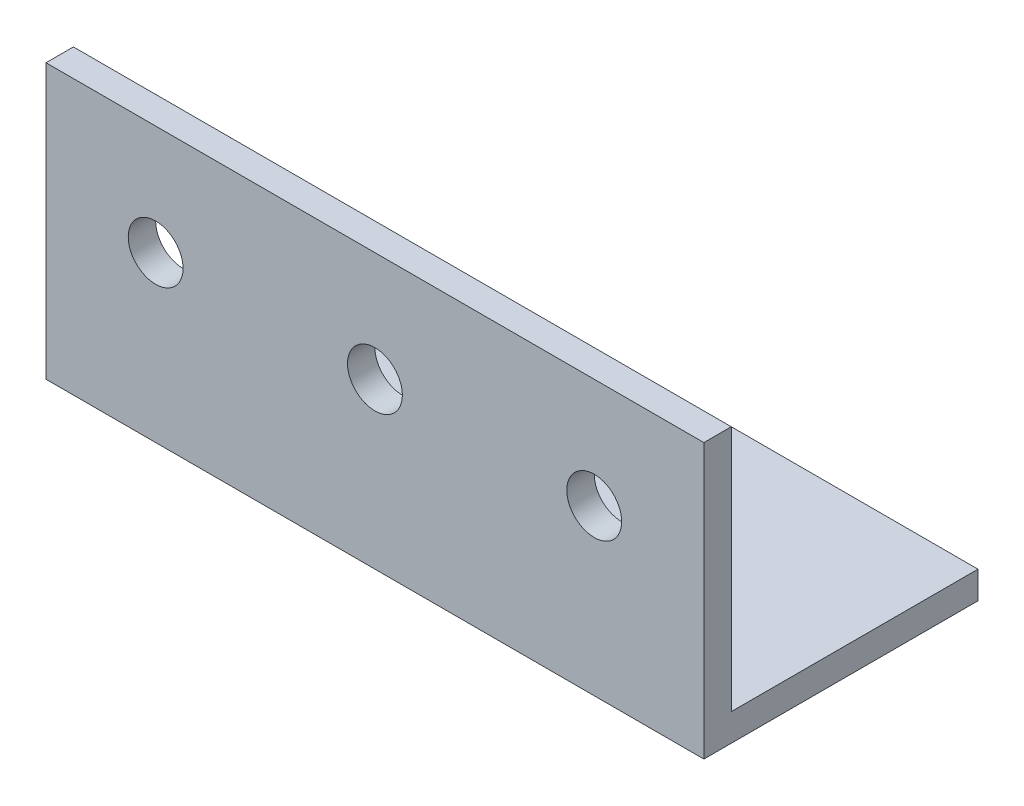
ISO-10303-21;
HEADER;
FILE_DESCRIPTION(('STEP AP214'),'2;1');
FILE_NAME('part.step','',(''),(''),'','','');
FILE_SCHEMA(('AUTOMOTIVE_DESIGN { 1 0 10303 214 1 1 1 1 }'));
ENDSEC;
DATA;
#1=APPLICATION_CONTEXT('core data for automotive mechanical design processes');
#2=APPLICATION_PROTOCOL_DEFINITION('international standard','automotive_design',2000,#1);
#3=PRODUCT_CONTEXT('',#1,'mechanical');
#4=PRODUCT('Part','Part','',(#3));
#5=PRODUCT_RELATED_PRODUCT_CATEGORY('part','',(#4));
#6=PRODUCT_DEFINITION_FORMATION('','',#4);
#7=PRODUCT_DEFINITION_CONTEXT('part definition',#1,'design');
#8=PRODUCT_DEFINITION('design','',#6,#7);
#9=PRODUCT_DEFINITION_SHAPE('','',#8);
#10=(LENGTH_UNIT() NAMED_UNIT(*) SI_UNIT(.MILLI.,.METRE.));
#11=(NAMED_UNIT(*) PLANE_ANGLE_UNIT() SI_UNIT($,.RADIAN.));
#12=(NAMED_UNIT(*) SI_UNIT($,.STERADIAN.) SOLID_ANGLE_UNIT());
#13=UNCERTAINTY_MEASURE_WITH_UNIT(LENGTH_MEASURE(1.E-05),#10,'distance_accuracy_value','');
#14=(GEOMETRIC_REPRESENTATION_CONTEXT(3) GLOBAL_UNCERTAINTY_ASSIGNED_CONTEXT((#13)) GLOBAL_UNIT_ASSIGNED_CONTEXT((#10,
#11,#12)) REPRESENTATION_CONTEXT('',''));
#15=CARTESIAN_POINT('',(0.,0.,0.));
#16=DIRECTION('',(0.,0.,1.));
#17=DIRECTION('',(1.,0.,0.));
#18=AXIS2_PLACEMENT_3D('',#15,#16,#17);
#19=CARTESIAN_POINT('',(76.2,0.,3.175));
#20=DIRECTION('',(0.,0.,1.));
#21=DIRECTION('',(1.,0.,0.));
#22=AXIS2_PLACEMENT_3D('',#19,#20,#21);
#23=PLANE('',#22);
#24=CARTESIAN_POINT('',(12.7,15.875,3.17500000000001));
#25=DIRECTION('',(0.,0.,1.));
#26=DIRECTION('',(1.,0.,0.));
#27=AXIS2_PLACEMENT_3D('',#24,#25,#26);
#28=CIRCLE('',#27,3.175);
#29=CARTESIAN_POINT('',(15.875,15.875,3.17500000000001));
#30=VERTEX_POINT('',#29);
#31=EDGE_CURVE('E134',#30,#30,#28,.T.);
#32=ORIENTED_EDGE('',*,*,#31,.F.);
#33=EDGE_LOOP('',(#32));
#34=FACE_BOUND('',#33,.T.);
#35=CARTESIAN_POINT('',(63.5,15.875,3.17500000000001));
#36=DIRECTION('',(0.,0.,1.));
#37=DIRECTION('',(1.,0.,0.));
#38=AXIS2_PLACEMENT_3D('',#35,#36,#37);
#39=CIRCLE('',#38,3.175);
#40=CARTESIAN_POINT('',(66.675,15.875,3.17500000000001));
#41=VERTEX_POINT('',#40);
#42=EDGE_CURVE('E175',#41,#41,#39,.T.);
#43=ORIENTED_EDGE('',*,*,#42,.F.);
#44=EDGE_LOOP('',(#43));
#45=FACE_BOUND('',#44,.T.);
#46=CARTESIAN_POINT('',(38.1,15.875,3.17500000000001));
#47=DIRECTION('',(0.,0.,1.));
#48=DIRECTION('',(1.,0.,0.));
#49=AXIS2_PLACEMENT_3D('',#46,#47,#48);
#50=CIRCLE('',#49,3.175);
#51=CARTESIAN_POINT('',(41.275,15.875,3.17500000000001));
#52=VERTEX_POINT('',#51);
#53=EDGE_CURVE('E179',#52,#52,#50,.T.);
#54=ORIENTED_EDGE('',*,*,#53,.F.);
#55=EDGE_LOOP('',(#54));
#56=FACE_BOUND('',#55,.T.);
#57=DIRECTION('',(0.,1.,0.));
#58=VECTOR('',#57,1.);
#59=CARTESIAN_POINT('',(0.,0.,3.175));
#60=LINE('',#59,#58);
#61=CARTESIAN_POINT('',(0.,-3.17499999999998,3.175));
#62=VERTEX_POINT('',#61);
#63=CARTESIAN_POINT('',(0.,28.575,3.175));
#64=VERTEX_POINT('',#63);
#65=EDGE_CURVE('E129',#62,#64,#60,.T.);
#66=ORIENTED_EDGE('',*,*,#65,.F.);
#67=DIRECTION('',(-1.,0.,0.));
#68=VECTOR('',#67,1.);
#69=CARTESIAN_POINT('',(76.2,-3.17499999999998,3.175));
#70=LINE('',#69,#68);
#71=CARTESIAN_POINT('',(76.2,-3.17499999999998,3.175));
#72=VERTEX_POINT('',#71);
#73=EDGE_CURVE('E11',#72,#62,#70,.T.);
#74=ORIENTED_EDGE('',*,*,#73,.F.);
#75=DIRECTION('',(0.,1.,0.));
#76=VECTOR('',#75,1.);
#77=CARTESIAN_POINT('',(76.2,0.,3.175));
#78=LINE('',#77,#76);
#79=CARTESIAN_POINT('',(76.2,28.575,3.175));
#80=VERTEX_POINT('',#79);
#81=EDGE_CURVE('E149',#72,#80,#78,.T.);
#82=ORIENTED_EDGE('',*,*,#81,.T.);
#83=DIRECTION('',(-1.,0.,0.));
#84=VECTOR('',#83,1.);
#85=CARTESIAN_POINT('',(76.2,28.575,3.175));
#86=LINE('',#85,#84);
#87=EDGE_CURVE('E86',#80,#64,#86,.T.);
#88=ORIENTED_EDGE('',*,*,#87,.T.);
#89=EDGE_LOOP('',(#66,#74,#82,#88));
#90=FACE_BOUND('',#89,.T.);
#91=ADVANCED_FACE('F41',(#34,#45,#56,#90),#23,.T.);
#92=CARTESIAN_POINT('',(76.2,-3.17499999999998,0.));
#93=DIRECTION('',(0.,1.,0.));
#94=DIRECTION('',(0.,0.,1.));
#95=AXIS2_PLACEMENT_3D('',#92,#93,#94);
#96=PLANE('',#95);
#97=DIRECTION('',(0.,0.,-1.));
#98=VECTOR('',#97,1.);
#99=CARTESIAN_POINT('',(0.,-3.17499999999998,0.));
#100=LINE('',#99,#98);
#101=CARTESIAN_POINT('',(0.,-3.17499999999998,-28.575));
#102=VERTEX_POINT('',#101);
#103=EDGE_CURVE('E133',#62,#102,#100,.T.);
#104=ORIENTED_EDGE('',*,*,#103,.T.);
#105=DIRECTION('',(-1.,0.,0.));
#106=VECTOR('',#105,1.);
#107=CARTESIAN_POINT('',(76.2,-3.17499999999998,-28.575));
#108=LINE('',#107,#106);
#109=CARTESIAN_POINT('',(76.2,-3.17499999999998,-28.575));
#110=VERTEX_POINT('',#109);
#111=EDGE_CURVE('E50',#110,#102,#108,.T.);
#112=ORIENTED_EDGE('',*,*,#111,.F.);
#113=DIRECTION('',(0.,0.,-1.));
#114=VECTOR('',#113,1.);
#115=CARTESIAN_POINT('',(76.2,-3.17499999999998,0.));
#116=LINE('',#115,#114);
#117=EDGE_CURVE('E123',#72,#110,#116,.T.);
#118=ORIENTED_EDGE('',*,*,#117,.F.);
#119=ORIENTED_EDGE('',*,*,#73,.T.);
#120=EDGE_LOOP('',(#104,#112,#118,#119));
#121=FACE_BOUND('',#120,.T.);
#122=ADVANCED_FACE('F162',(#121),#96,.F.);
#123=CARTESIAN_POINT('',(76.2,0.,-28.575));
#124=DIRECTION('',(0.,0.,-1.));
#125=DIRECTION('',(-1.,0.,0.));
#126=AXIS2_PLACEMENT_3D('',#123,#124,#125);
#127=PLANE('',#126);
#128=DIRECTION('',(0.,-1.,0.));
#129=VECTOR('',#128,1.);
#130=CARTESIAN_POINT('',(0.,0.,-28.575));
#131=LINE('',#130,#129);
#132=CARTESIAN_POINT('',(0.,0.,-28.575));
#133=VERTEX_POINT('',#132);
#134=EDGE_CURVE('E138',#133,#102,#131,.T.);
#135=ORIENTED_EDGE('',*,*,#134,.F.);
#136=DIRECTION('',(-1.,0.,0.));
#137=VECTOR('',#136,1.);
#138=CARTESIAN_POINT('',(76.2,0.,-28.575));
#139=LINE('',#138,#137);
#140=CARTESIAN_POINT('',(76.2,0.,-28.575));
#141=VERTEX_POINT('',#140);
#142=EDGE_CURVE('E109',#141,#133,#139,.T.);
#143=ORIENTED_EDGE('',*,*,#142,.F.);
#144=DIRECTION('',(0.,-1.,0.));
#145=VECTOR('',#144,1.);
#146=CARTESIAN_POINT('',(76.2,0.,-28.575));
#147=LINE('',#146,#145);
#148=EDGE_CURVE('E119',#141,#110,#147,.T.);
#149=ORIENTED_EDGE('',*,*,#148,.T.);
#150=ORIENTED_EDGE('',*,*,#111,.T.);
#151=EDGE_LOOP('',(#135,#143,#149,#150));
#152=FACE_BOUND('',#151,.T.);
#153=ADVANCED_FACE('F159',(#152),#127,.T.);
#154=CARTESIAN_POINT('',(76.2,0.,0.));
#155=DIRECTION('',(0.,1.,0.));
#156=DIRECTION('',(0.,0.,1.));
#157=AXIS2_PLACEMENT_3D('',#154,#155,#156);
#158=PLANE('',#157);
#159=DIRECTION('',(0.,0.,-1.));
#160=VECTOR('',#159,1.);
#161=CARTESIAN_POINT('',(0.,0.,0.));
#162=LINE('',#161,#160);
#163=CARTESIAN_POINT('',(0.,0.,0.));
#164=VERTEX_POINT('',#163);
#165=EDGE_CURVE('E107',#164,#133,#162,.T.);
#166=ORIENTED_EDGE('',*,*,#165,.F.);
#167=DIRECTION('',(-1.,0.,0.));
#168=VECTOR('',#167,1.);
#169=CARTESIAN_POINT('',(76.2,0.,0.));
#170=LINE('',#169,#168);
#171=CARTESIAN_POINT('',(76.2,0.,0.));
#172=VERTEX_POINT('',#171);
#173=EDGE_CURVE('E101',#172,#164,#170,.T.);
#174=ORIENTED_EDGE('',*,*,#173,.F.);
#175=DIRECTION('',(0.,0.,-1.));
#176=VECTOR('',#175,1.);
#177=CARTESIAN_POINT('',(76.2,0.,0.));
#178=LINE('',#177,#176);
#179=EDGE_CURVE('E105',#172,#141,#178,.T.);
#180=ORIENTED_EDGE('',*,*,#179,.T.);
#181=ORIENTED_EDGE('',*,*,#142,.T.);
#182=EDGE_LOOP('',(#166,#174,#180,#181));
#183=FACE_BOUND('',#182,.T.);
#184=ADVANCED_FACE('F103',(#183),#158,.T.);
#185=CARTESIAN_POINT('',(76.2,0.,0.));
#186=DIRECTION('',(0.,0.,1.));
#187=DIRECTION('',(1.,0.,0.));
#188=AXIS2_PLACEMENT_3D('',#185,#186,#187);
#189=PLANE('',#188);
#190=CARTESIAN_POINT('',(12.7,15.875,0.));
#191=DIRECTION('',(0.,0.,-1.));
#192=DIRECTION('',(-1.,0.,0.));
#193=AXIS2_PLACEMENT_3D('',#190,#191,#192);
#194=CIRCLE('',#193,3.175);
#195=CARTESIAN_POINT('',(9.525,15.875,0.));
#196=VERTEX_POINT('',#195);
#197=EDGE_CURVE('E188',#196,#196,#194,.T.);
#198=ORIENTED_EDGE('',*,*,#197,.F.);
#199=EDGE_LOOP('',(#198));
#200=FACE_BOUND('',#199,.T.);
#201=CARTESIAN_POINT('',(63.5,15.875,0.));
#202=DIRECTION('',(0.,0.,-1.));
#203=DIRECTION('',(-1.,0.,0.));
#204=AXIS2_PLACEMENT_3D('',#201,#202,#203);
#205=CIRCLE('',#204,3.175);
#206=CARTESIAN_POINT('',(60.325,15.875,0.));
#207=VERTEX_POINT('',#206);
#208=EDGE_CURVE('E187',#207,#207,#205,.T.);
#209=ORIENTED_EDGE('',*,*,#208,.F.);
#210=EDGE_LOOP('',(#209));
#211=FACE_BOUND('',#210,.T.);
#212=CARTESIAN_POINT('',(38.1,15.875,0.));
#213=DIRECTION('',(0.,0.,-1.));
#214=DIRECTION('',(-1.,0.,0.));
#215=AXIS2_PLACEMENT_3D('',#212,#213,#214);
#216=CIRCLE('',#215,3.175);
#217=CARTESIAN_POINT('',(34.925,15.875,0.));
#218=VERTEX_POINT('',#217);
#219=EDGE_CURVE('E183',#218,#218,#216,.T.);
#220=ORIENTED_EDGE('',*,*,#219,.F.);
#221=EDGE_LOOP('',(#220));
#222=FACE_BOUND('',#221,.T.);
#223=DIRECTION('',(0.,1.,0.));
#224=VECTOR('',#223,1.);
#225=CARTESIAN_POINT('',(0.,0.,0.));
#226=LINE('',#225,#224);
#227=CARTESIAN_POINT('',(0.,28.575,0.));
#228=VERTEX_POINT('',#227);
#229=EDGE_CURVE('E79',#164,#228,#226,.T.);
#230=ORIENTED_EDGE('',*,*,#229,.T.);
#231=DIRECTION('',(-1.,0.,0.));
#232=VECTOR('',#231,1.);
#233=CARTESIAN_POINT('',(76.2,28.575,0.));
#234=LINE('',#233,#232);
#235=CARTESIAN_POINT('',(76.2,28.575,0.));
#236=VERTEX_POINT('',#235);
#237=EDGE_CURVE('E110',#236,#228,#234,.T.);
#238=ORIENTED_EDGE('',*,*,#237,.F.);
#239=DIRECTION('',(0.,1.,0.));
#240=VECTOR('',#239,1.);
#241=CARTESIAN_POINT('',(76.2,0.,0.));
#242=LINE('',#241,#240);
#243=EDGE_CURVE('E112',#172,#236,#242,.T.);
#244=ORIENTED_EDGE('',*,*,#243,.F.);
#245=ORIENTED_EDGE('',*,*,#173,.T.);
#246=EDGE_LOOP('',(#230,#238,#244,#245));
#247=FACE_BOUND('',#246,.T.);
#248=ADVANCED_FACE('F113',(#200,#211,#222,#247),#189,.F.);
#249=CARTESIAN_POINT('',(76.2,28.575,0.));
#250=DIRECTION('',(0.,-1.,0.));
#251=DIRECTION('',(0.,0.,-1.));
#252=AXIS2_PLACEMENT_3D('',#249,#250,#251);
#253=PLANE('',#252);
#254=DIRECTION('',(0.,0.,1.));
#255=VECTOR('',#254,1.);
#256=CARTESIAN_POINT('',(0.,28.575,0.));
#257=LINE('',#256,#255);
#258=EDGE_CURVE('E146',#228,#64,#257,.T.);
#259=ORIENTED_EDGE('',*,*,#258,.T.);
#260=ORIENTED_EDGE('',*,*,#87,.F.);
#261=DIRECTION('',(0.,0.,1.));
#262=VECTOR('',#261,1.);
#263=CARTESIAN_POINT('',(76.2,28.575,0.));
#264=LINE('',#263,#262);
#265=EDGE_CURVE('E58',#236,#80,#264,.T.);
#266=ORIENTED_EDGE('',*,*,#265,.F.);
#267=ORIENTED_EDGE('',*,*,#237,.T.);
#268=EDGE_LOOP('',(#259,#260,#266,#267));
#269=FACE_BOUND('',#268,.T.);
#270=ADVANCED_FACE('F167',(#269),#253,.F.);
#271=CARTESIAN_POINT('',(76.2,0.,0.));
#272=DIRECTION('',(1.,0.,0.));
#273=DIRECTION('',(0.,0.,-1.));
#274=AXIS2_PLACEMENT_3D('',#271,#272,#273);
#275=PLANE('',#274);
#276=ORIENTED_EDGE('',*,*,#81,.F.);
#277=ORIENTED_EDGE('',*,*,#117,.T.);
#278=ORIENTED_EDGE('',*,*,#148,.F.);
#279=ORIENTED_EDGE('',*,*,#179,.F.);
#280=ORIENTED_EDGE('',*,*,#243,.T.);
#281=ORIENTED_EDGE('',*,*,#265,.T.);
#282=EDGE_LOOP('',(#276,#277,#278,#279,#280,#281));
#283=FACE_BOUND('',#282,.T.);
#284=ADVANCED_FACE('F117',(#283),#275,.T.);
#285=CARTESIAN_POINT('',(0.,0.,0.));
#286=DIRECTION('',(1.,0.,0.));
#287=DIRECTION('',(0.,0.,-1.));
#288=AXIS2_PLACEMENT_3D('',#285,#286,#287);
#289=PLANE('',#288);
#290=ORIENTED_EDGE('',*,*,#65,.T.);
#291=ORIENTED_EDGE('',*,*,#258,.F.);
#292=ORIENTED_EDGE('',*,*,#229,.F.);
#293=ORIENTED_EDGE('',*,*,#165,.T.);
#294=ORIENTED_EDGE('',*,*,#134,.T.);
#295=ORIENTED_EDGE('',*,*,#103,.F.);
#296=EDGE_LOOP('',(#290,#291,#292,#293,#294,#295));
#297=FACE_BOUND('',#296,.T.);
#298=ADVANCED_FACE('F164',(#297),#289,.F.);
#299=CARTESIAN_POINT('',(38.1,15.875,76.2));
#300=DIRECTION('',(0.,0.,-1.));
#301=DIRECTION('',(-1.,0.,0.));
#302=AXIS2_PLACEMENT_3D('',#299,#300,#301);
#303=CYLINDRICAL_SURFACE('',#302,3.175);
#304=ORIENTED_EDGE('',*,*,#53,.T.);
#305=EDGE_LOOP('',(#304));
#306=FACE_BOUND('',#305,.T.);
#307=ORIENTED_EDGE('',*,*,#219,.T.);
#308=EDGE_LOOP('',(#307));
#309=FACE_BOUND('',#308,.T.);
#310=ADVANCED_FACE('F204',(#306,#309),#303,.F.);
#311=CARTESIAN_POINT('',(63.5,15.875,76.2));
#312=DIRECTION('',(0.,0.,-1.));
#313=DIRECTION('',(-1.,0.,0.));
#314=AXIS2_PLACEMENT_3D('',#311,#312,#313);
#315=CYLINDRICAL_SURFACE('',#314,3.175);
#316=ORIENTED_EDGE('',*,*,#42,.T.);
#317=EDGE_LOOP('',(#316));
#318=FACE_BOUND('',#317,.T.);
#319=ORIENTED_EDGE('',*,*,#208,.T.);
#320=EDGE_LOOP('',(#319));
#321=FACE_BOUND('',#320,.T.);
#322=ADVANCED_FACE('F196',(#318,#321),#315,.F.);
#323=CARTESIAN_POINT('',(12.7,15.875,76.2));
#324=DIRECTION('',(0.,0.,-1.));
#325=DIRECTION('',(-1.,0.,0.));
#326=AXIS2_PLACEMENT_3D('',#323,#324,#325);
#327=CYLINDRICAL_SURFACE('',#326,3.175);
#328=ORIENTED_EDGE('',*,*,#31,.T.);
#329=EDGE_LOOP('',(#328));
#330=FACE_BOUND('',#329,.T.);
#331=ORIENTED_EDGE('',*,*,#197,.T.);
#332=EDGE_LOOP('',(#331));
#333=FACE_BOUND('',#332,.T.);
#334=ADVANCED_FACE('F212',(#330,#333),#327,.F.);
#335=CLOSED_SHELL('',(#91,#122,#153,#184,#248,#270,#284,#298,#310,#322,#334));
#336=MANIFOLD_SOLID_BREP('B2',#335);
#337=ADVANCED_BREP_SHAPE_REPRESENTATION('',(#18,#336),#14);
#338=SHAPE_DEFINITION_REPRESENTATION(#9,#337);
ENDSEC;
END-ISO-10303-21;
